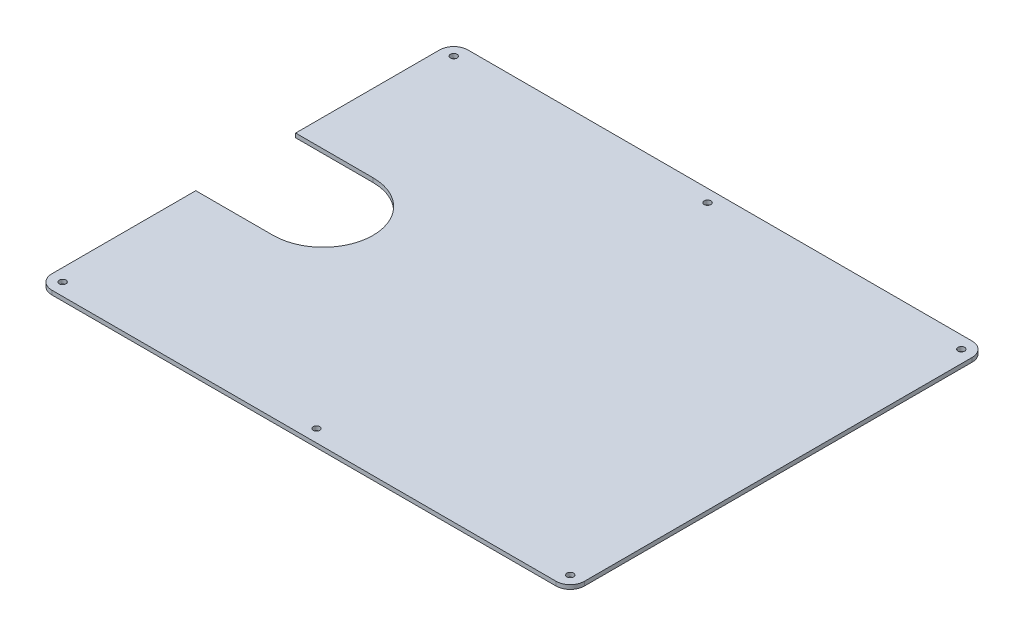
ISO-10303-21;
HEADER;
FILE_DESCRIPTION(('STEP AP214'),'2;1');
FILE_NAME('part.step','',(''),(''),'','','');
FILE_SCHEMA(('AUTOMOTIVE_DESIGN { 1 0 10303 214 1 1 1 1 }'));
ENDSEC;
DATA;
#1=APPLICATION_CONTEXT('core data for automotive mechanical design processes');
#2=APPLICATION_PROTOCOL_DEFINITION('international standard','automotive_design',2000,#1);
#3=PRODUCT_CONTEXT('',#1,'mechanical');
#4=PRODUCT('Part','Part','',(#3));
#5=PRODUCT_RELATED_PRODUCT_CATEGORY('part','',(#4));
#6=PRODUCT_DEFINITION_FORMATION('','',#4);
#7=PRODUCT_DEFINITION_CONTEXT('part definition',#1,'design');
#8=PRODUCT_DEFINITION('design','',#6,#7);
#9=PRODUCT_DEFINITION_SHAPE('','',#8);
#10=(LENGTH_UNIT() NAMED_UNIT(*) SI_UNIT(.MILLI.,.METRE.));
#11=(NAMED_UNIT(*) PLANE_ANGLE_UNIT() SI_UNIT($,.RADIAN.));
#12=(NAMED_UNIT(*) SI_UNIT($,.STERADIAN.) SOLID_ANGLE_UNIT());
#13=UNCERTAINTY_MEASURE_WITH_UNIT(LENGTH_MEASURE(1.E-05),#10,'distance_accuracy_value','');
#14=(GEOMETRIC_REPRESENTATION_CONTEXT(3) GLOBAL_UNCERTAINTY_ASSIGNED_CONTEXT((#13)) GLOBAL_UNIT_ASSIGNED_CONTEXT((#10,
#11,#12)) REPRESENTATION_CONTEXT('',''));
#15=CARTESIAN_POINT('',(0.,0.,0.));
#16=DIRECTION('',(0.,0.,1.));
#17=DIRECTION('',(1.,0.,0.));
#18=AXIS2_PLACEMENT_3D('',#15,#16,#17);
#19=CARTESIAN_POINT('',(-320.,5.,-233.));
#20=DIRECTION('',(1.,0.,0.));
#21=DIRECTION('',(0.,0.,-1.));
#22=AXIS2_PLACEMENT_3D('',#19,#20,#21);
#23=PLANE('',#22);
#24=DIRECTION('',(0.,0.,1.));
#25=VECTOR('',#24,1.);
#26=CARTESIAN_POINT('',(-320.,0.,-233.));
#27=LINE('',#26,#25);
#28=CARTESIAN_POINT('',(-320.,0.,-233.));
#29=VERTEX_POINT('',#28);
#30=CARTESIAN_POINT('',(-320.,0.,-60.));
#31=VERTEX_POINT('',#30);
#32=EDGE_CURVE('E176',#29,#31,#27,.T.);
#33=ORIENTED_EDGE('',*,*,#32,.T.);
#34=DIRECTION('',(0.,-1.,0.));
#35=VECTOR('',#34,1.);
#36=CARTESIAN_POINT('',(-320.,5.,-60.));
#37=LINE('',#36,#35);
#38=CARTESIAN_POINT('',(-320.,5.,-60.));
#39=VERTEX_POINT('',#38);
#40=EDGE_CURVE('E261',#39,#31,#37,.T.);
#41=ORIENTED_EDGE('',*,*,#40,.F.);
#42=DIRECTION('',(0.,0.,1.));
#43=VECTOR('',#42,1.);
#44=CARTESIAN_POINT('',(-320.,5.,-233.));
#45=LINE('',#44,#43);
#46=CARTESIAN_POINT('',(-320.,5.,-233.));
#47=VERTEX_POINT('',#46);
#48=EDGE_CURVE('E153',#47,#39,#45,.T.);
#49=ORIENTED_EDGE('',*,*,#48,.F.);
#50=DIRECTION('',(0.,-1.,0.));
#51=VECTOR('',#50,1.);
#52=CARTESIAN_POINT('',(-320.,5.,-233.));
#53=LINE('',#52,#51);
#54=EDGE_CURVE('E146',#47,#29,#53,.T.);
#55=ORIENTED_EDGE('',*,*,#54,.T.);
#56=EDGE_LOOP('',(#33,#41,#49,#55));
#57=FACE_BOUND('',#56,.T.);
#58=ADVANCED_FACE('F38',(#57),#23,.F.);
#59=CARTESIAN_POINT('',(-303.,5.,233.));
#60=DIRECTION('',(0.,1.,0.));
#61=DIRECTION('',(0.,0.,1.));
#62=AXIS2_PLACEMENT_3D('',#59,#60,#61);
#63=PLANE('',#62);
#64=DIRECTION('',(1.,0.,0.));
#65=VECTOR('',#64,1.);
#66=CARTESIAN_POINT('',(-320.,5.,-60.));
#67=LINE('',#66,#65);
#68=CARTESIAN_POINT('',(-227.,5.,-60.));
#69=VERTEX_POINT('',#68);
#70=EDGE_CURVE('E258',#39,#69,#67,.T.);
#71=ORIENTED_EDGE('',*,*,#70,.T.);
#72=CARTESIAN_POINT('',(-227.,5.,0.));
#73=DIRECTION('',(0.,-1.,0.));
#74=DIRECTION('',(0.,0.,1.));
#75=AXIS2_PLACEMENT_3D('',#72,#73,#74);
#76=CIRCLE('',#75,60.);
#77=CARTESIAN_POINT('',(-227.,5.,60.));
#78=VERTEX_POINT('',#77);
#79=EDGE_CURVE('E269',#69,#78,#76,.T.);
#80=ORIENTED_EDGE('',*,*,#79,.T.);
#81=DIRECTION('',(-1.,0.,0.));
#82=VECTOR('',#81,1.);
#83=CARTESIAN_POINT('',(-227.,5.,60.));
#84=LINE('',#83,#82);
#85=CARTESIAN_POINT('',(-320.,5.,60.));
#86=VERTEX_POINT('',#85);
#87=EDGE_CURVE('E277',#78,#86,#84,.T.);
#88=ORIENTED_EDGE('',*,*,#87,.T.);
#89=CARTESIAN_POINT('',(-320.,5.,233.));
#90=VERTEX_POINT('',#89);
#91=EDGE_CURVE('E65',#86,#90,#45,.T.);
#92=ORIENTED_EDGE('',*,*,#91,.T.);
#93=CARTESIAN_POINT('',(-303.,5.,233.));
#94=DIRECTION('',(0.,1.,0.));
#95=DIRECTION('',(0.,0.,1.));
#96=AXIS2_PLACEMENT_3D('',#93,#94,#95);
#97=CIRCLE('',#96,17.);
#98=CARTESIAN_POINT('',(-303.,5.,250.));
#99=VERTEX_POINT('',#98);
#100=EDGE_CURVE('E179',#90,#99,#97,.T.);
#101=ORIENTED_EDGE('',*,*,#100,.T.);
#102=DIRECTION('',(1.,0.,0.));
#103=VECTOR('',#102,1.);
#104=CARTESIAN_POINT('',(-303.,5.,250.));
#105=LINE('',#104,#103);
#106=CARTESIAN_POINT('',(303.,5.,250.));
#107=VERTEX_POINT('',#106);
#108=EDGE_CURVE('E107',#99,#107,#105,.T.);
#109=ORIENTED_EDGE('',*,*,#108,.T.);
#110=CARTESIAN_POINT('',(303.,5.,233.));
#111=DIRECTION('',(0.,1.,0.));
#112=DIRECTION('',(0.,0.,-1.));
#113=AXIS2_PLACEMENT_3D('',#110,#111,#112);
#114=CIRCLE('',#113,17.);
#115=CARTESIAN_POINT('',(320.,5.,233.));
#116=VERTEX_POINT('',#115);
#117=EDGE_CURVE('E195',#107,#116,#114,.T.);
#118=ORIENTED_EDGE('',*,*,#117,.T.);
#119=DIRECTION('',(0.,0.,-1.));
#120=VECTOR('',#119,1.);
#121=CARTESIAN_POINT('',(320.,5.,-233.));
#122=LINE('',#121,#120);
#123=CARTESIAN_POINT('',(320.,5.,-233.));
#124=VERTEX_POINT('',#123);
#125=EDGE_CURVE('E209',#116,#124,#122,.T.);
#126=ORIENTED_EDGE('',*,*,#125,.T.);
#127=CARTESIAN_POINT('',(303.,5.,-233.));
#128=DIRECTION('',(0.,1.,0.));
#129=DIRECTION('',(0.,0.,-1.));
#130=AXIS2_PLACEMENT_3D('',#127,#128,#129);
#131=CIRCLE('',#130,17.);
#132=CARTESIAN_POINT('',(303.,5.,-250.));
#133=VERTEX_POINT('',#132);
#134=EDGE_CURVE('E133',#124,#133,#131,.T.);
#135=ORIENTED_EDGE('',*,*,#134,.T.);
#136=DIRECTION('',(-1.,0.,0.));
#137=VECTOR('',#136,1.);
#138=CARTESIAN_POINT('',(-303.,5.,-250.));
#139=LINE('',#138,#137);
#140=CARTESIAN_POINT('',(-303.,5.,-250.));
#141=VERTEX_POINT('',#140);
#142=EDGE_CURVE('E123',#133,#141,#139,.T.);
#143=ORIENTED_EDGE('',*,*,#142,.T.);
#144=CARTESIAN_POINT('',(-303.,5.,-233.));
#145=DIRECTION('',(0.,1.,0.));
#146=DIRECTION('',(0.,0.,1.));
#147=AXIS2_PLACEMENT_3D('',#144,#145,#146);
#148=CIRCLE('',#147,17.);
#149=EDGE_CURVE('E130',#141,#47,#148,.T.);
#150=ORIENTED_EDGE('',*,*,#149,.T.);
#151=ORIENTED_EDGE('',*,*,#48,.T.);
#152=EDGE_LOOP('',(#71,#80,#88,#92,#101,#109,#118,#126,#135,#143,#150,#151));
#153=FACE_BOUND('',#152,.T.);
#154=CARTESIAN_POINT('',(305.,5.,235.));
#155=DIRECTION('',(0.,1.,0.));
#156=DIRECTION('',(0.,0.,1.));
#157=AXIS2_PLACEMENT_3D('',#154,#155,#156);
#158=CIRCLE('',#157,3.99999999999999);
#159=CARTESIAN_POINT('',(305.,5.,239.));
#160=VERTEX_POINT('',#159);
#161=EDGE_CURVE('E238',#160,#160,#158,.T.);
#162=ORIENTED_EDGE('',*,*,#161,.F.);
#163=EDGE_LOOP('',(#162));
#164=FACE_BOUND('',#163,.T.);
#165=CARTESIAN_POINT('',(-305.,5.,-235.));
#166=DIRECTION('',(0.,1.,0.));
#167=DIRECTION('',(0.,0.,1.));
#168=AXIS2_PLACEMENT_3D('',#165,#166,#167);
#169=CIRCLE('',#168,3.99999999999999);
#170=CARTESIAN_POINT('',(-305.,5.,-231.));
#171=VERTEX_POINT('',#170);
#172=EDGE_CURVE('E226',#171,#171,#169,.T.);
#173=ORIENTED_EDGE('',*,*,#172,.F.);
#174=EDGE_LOOP('',(#173));
#175=FACE_BOUND('',#174,.T.);
#176=CARTESIAN_POINT('',(0.,5.,-235.));
#177=DIRECTION('',(0.,1.,0.));
#178=DIRECTION('',(0.,0.,1.));
#179=AXIS2_PLACEMENT_3D('',#176,#177,#178);
#180=CIRCLE('',#179,4.);
#181=CARTESIAN_POINT('',(0.,5.,-231.));
#182=VERTEX_POINT('',#181);
#183=EDGE_CURVE('E162',#182,#182,#180,.T.);
#184=ORIENTED_EDGE('',*,*,#183,.F.);
#185=EDGE_LOOP('',(#184));
#186=FACE_BOUND('',#185,.T.);
#187=CARTESIAN_POINT('',(305.,5.,-235.));
#188=DIRECTION('',(0.,1.,0.));
#189=DIRECTION('',(0.,0.,1.));
#190=AXIS2_PLACEMENT_3D('',#187,#188,#189);
#191=CIRCLE('',#190,3.99999999999999);
#192=CARTESIAN_POINT('',(305.,5.,-231.));
#193=VERTEX_POINT('',#192);
#194=EDGE_CURVE('E220',#193,#193,#191,.T.);
#195=ORIENTED_EDGE('',*,*,#194,.F.);
#196=EDGE_LOOP('',(#195));
#197=FACE_BOUND('',#196,.T.);
#198=CARTESIAN_POINT('',(0.,5.,235.));
#199=DIRECTION('',(0.,1.,0.));
#200=DIRECTION('',(0.,0.,1.));
#201=AXIS2_PLACEMENT_3D('',#198,#199,#200);
#202=CIRCLE('',#201,4.);
#203=CARTESIAN_POINT('',(0.,5.,239.));
#204=VERTEX_POINT('',#203);
#205=EDGE_CURVE('E232',#204,#204,#202,.T.);
#206=ORIENTED_EDGE('',*,*,#205,.F.);
#207=EDGE_LOOP('',(#206));
#208=FACE_BOUND('',#207,.T.);
#209=CARTESIAN_POINT('',(-305.,5.,235.));
#210=DIRECTION('',(0.,1.,0.));
#211=DIRECTION('',(0.,0.,1.));
#212=AXIS2_PLACEMENT_3D('',#209,#210,#211);
#213=CIRCLE('',#212,3.99999999999999);
#214=CARTESIAN_POINT('',(-305.,5.,239.));
#215=VERTEX_POINT('',#214);
#216=EDGE_CURVE('E245',#215,#215,#213,.T.);
#217=ORIENTED_EDGE('',*,*,#216,.F.);
#218=EDGE_LOOP('',(#217));
#219=FACE_BOUND('',#218,.T.);
#220=ADVANCED_FACE('F126',(#153,#164,#175,#186,#197,#208,#219),#63,.T.);
#221=CARTESIAN_POINT('',(-303.,0.,233.));
#222=DIRECTION('',(0.,1.,0.));
#223=DIRECTION('',(0.,0.,1.));
#224=AXIS2_PLACEMENT_3D('',#221,#222,#223);
#225=PLANE('',#224);
#226=CARTESIAN_POINT('',(-227.,0.,0.));
#227=DIRECTION('',(0.,-1.,0.));
#228=DIRECTION('',(0.,0.,1.));
#229=AXIS2_PLACEMENT_3D('',#226,#227,#228);
#230=CIRCLE('',#229,60.);
#231=CARTESIAN_POINT('',(-227.,0.,-60.));
#232=VERTEX_POINT('',#231);
#233=CARTESIAN_POINT('',(-227.,0.,60.));
#234=VERTEX_POINT('',#233);
#235=EDGE_CURVE('E272',#232,#234,#230,.T.);
#236=ORIENTED_EDGE('',*,*,#235,.F.);
#237=DIRECTION('',(1.,0.,0.));
#238=VECTOR('',#237,1.);
#239=CARTESIAN_POINT('',(-320.,0.,-60.));
#240=LINE('',#239,#238);
#241=EDGE_CURVE('E266',#31,#232,#240,.T.);
#242=ORIENTED_EDGE('',*,*,#241,.F.);
#243=ORIENTED_EDGE('',*,*,#32,.F.);
#244=CARTESIAN_POINT('',(-303.,0.,-233.));
#245=DIRECTION('',(0.,1.,0.));
#246=DIRECTION('',(0.,0.,1.));
#247=AXIS2_PLACEMENT_3D('',#244,#245,#246);
#248=CIRCLE('',#247,17.);
#249=CARTESIAN_POINT('',(-303.,0.,-250.));
#250=VERTEX_POINT('',#249);
#251=EDGE_CURVE('E174',#250,#29,#248,.T.);
#252=ORIENTED_EDGE('',*,*,#251,.F.);
#253=DIRECTION('',(-1.,0.,0.));
#254=VECTOR('',#253,1.);
#255=CARTESIAN_POINT('',(-303.,0.,-250.));
#256=LINE('',#255,#254);
#257=CARTESIAN_POINT('',(303.,0.,-250.));
#258=VERTEX_POINT('',#257);
#259=EDGE_CURVE('E142',#258,#250,#256,.T.);
#260=ORIENTED_EDGE('',*,*,#259,.F.);
#261=CARTESIAN_POINT('',(303.,0.,-233.));
#262=DIRECTION('',(0.,1.,0.));
#263=DIRECTION('',(0.,0.,-1.));
#264=AXIS2_PLACEMENT_3D('',#261,#262,#263);
#265=CIRCLE('',#264,17.);
#266=CARTESIAN_POINT('',(320.,0.,-233.));
#267=VERTEX_POINT('',#266);
#268=EDGE_CURVE('E171',#267,#258,#265,.T.);
#269=ORIENTED_EDGE('',*,*,#268,.F.);
#270=DIRECTION('',(0.,0.,-1.));
#271=VECTOR('',#270,1.);
#272=CARTESIAN_POINT('',(320.,0.,-233.));
#273=LINE('',#272,#271);
#274=CARTESIAN_POINT('',(320.,0.,233.));
#275=VERTEX_POINT('',#274);
#276=EDGE_CURVE('E168',#275,#267,#273,.T.);
#277=ORIENTED_EDGE('',*,*,#276,.F.);
#278=CARTESIAN_POINT('',(303.,0.,233.));
#279=DIRECTION('',(0.,1.,0.));
#280=DIRECTION('',(0.,0.,-1.));
#281=AXIS2_PLACEMENT_3D('',#278,#279,#280);
#282=CIRCLE('',#281,17.);
#283=CARTESIAN_POINT('',(303.,0.,250.));
#284=VERTEX_POINT('',#283);
#285=EDGE_CURVE('E165',#284,#275,#282,.T.);
#286=ORIENTED_EDGE('',*,*,#285,.F.);
#287=DIRECTION('',(1.,0.,0.));
#288=VECTOR('',#287,1.);
#289=CARTESIAN_POINT('',(-303.,0.,250.));
#290=LINE('',#289,#288);
#291=CARTESIAN_POINT('',(-303.,0.,250.));
#292=VERTEX_POINT('',#291);
#293=EDGE_CURVE('E161',#292,#284,#290,.T.);
#294=ORIENTED_EDGE('',*,*,#293,.F.);
#295=CARTESIAN_POINT('',(-303.,0.,233.));
#296=DIRECTION('',(0.,1.,0.));
#297=DIRECTION('',(0.,0.,1.));
#298=AXIS2_PLACEMENT_3D('',#295,#296,#297);
#299=CIRCLE('',#298,17.);
#300=CARTESIAN_POINT('',(-320.,0.,233.));
#301=VERTEX_POINT('',#300);
#302=EDGE_CURVE('E158',#301,#292,#299,.T.);
#303=ORIENTED_EDGE('',*,*,#302,.F.);
#304=CARTESIAN_POINT('',(-320.,0.,60.0000000000001));
#305=VERTEX_POINT('',#304);
#306=EDGE_CURVE('E99',#305,#301,#27,.T.);
#307=ORIENTED_EDGE('',*,*,#306,.F.);
#308=DIRECTION('',(-1.,0.,0.));
#309=VECTOR('',#308,1.);
#310=CARTESIAN_POINT('',(-227.,0.,60.));
#311=LINE('',#310,#309);
#312=EDGE_CURVE('E56',#234,#305,#311,.T.);
#313=ORIENTED_EDGE('',*,*,#312,.F.);
#314=EDGE_LOOP('',(#236,#242,#243,#252,#260,#269,#277,#286,#294,#303,#307,#313));
#315=FACE_BOUND('',#314,.T.);
#316=CARTESIAN_POINT('',(0.,0.,-235.));
#317=DIRECTION('',(0.,1.,0.));
#318=DIRECTION('',(0.,0.,1.));
#319=AXIS2_PLACEMENT_3D('',#316,#317,#318);
#320=CIRCLE('',#319,4.);
#321=CARTESIAN_POINT('',(0.,0.,-231.));
#322=VERTEX_POINT('',#321);
#323=EDGE_CURVE('E217',#322,#322,#320,.T.);
#324=ORIENTED_EDGE('',*,*,#323,.T.);
#325=EDGE_LOOP('',(#324));
#326=FACE_BOUND('',#325,.T.);
#327=CARTESIAN_POINT('',(305.,0.,-235.));
#328=DIRECTION('',(0.,1.,0.));
#329=DIRECTION('',(0.,0.,1.));
#330=AXIS2_PLACEMENT_3D('',#327,#328,#329);
#331=CIRCLE('',#330,3.99999999999999);
#332=CARTESIAN_POINT('',(305.,0.,-231.));
#333=VERTEX_POINT('',#332);
#334=EDGE_CURVE('E223',#333,#333,#331,.T.);
#335=ORIENTED_EDGE('',*,*,#334,.T.);
#336=EDGE_LOOP('',(#335));
#337=FACE_BOUND('',#336,.T.);
#338=CARTESIAN_POINT('',(-305.,0.,-235.));
#339=DIRECTION('',(0.,1.,0.));
#340=DIRECTION('',(0.,0.,1.));
#341=AXIS2_PLACEMENT_3D('',#338,#339,#340);
#342=CIRCLE('',#341,3.99999999999999);
#343=CARTESIAN_POINT('',(-305.,0.,-231.));
#344=VERTEX_POINT('',#343);
#345=EDGE_CURVE('E229',#344,#344,#342,.T.);
#346=ORIENTED_EDGE('',*,*,#345,.T.);
#347=EDGE_LOOP('',(#346));
#348=FACE_BOUND('',#347,.T.);
#349=CARTESIAN_POINT('',(0.,0.,235.));
#350=DIRECTION('',(0.,1.,0.));
#351=DIRECTION('',(0.,0.,1.));
#352=AXIS2_PLACEMENT_3D('',#349,#350,#351);
#353=CIRCLE('',#352,4.);
#354=CARTESIAN_POINT('',(0.,0.,239.));
#355=VERTEX_POINT('',#354);
#356=EDGE_CURVE('E235',#355,#355,#353,.T.);
#357=ORIENTED_EDGE('',*,*,#356,.T.);
#358=EDGE_LOOP('',(#357));
#359=FACE_BOUND('',#358,.T.);
#360=CARTESIAN_POINT('',(305.,0.,235.));
#361=DIRECTION('',(0.,1.,0.));
#362=DIRECTION('',(0.,0.,1.));
#363=AXIS2_PLACEMENT_3D('',#360,#361,#362);
#364=CIRCLE('',#363,3.99999999999999);
#365=CARTESIAN_POINT('',(305.,0.,239.));
#366=VERTEX_POINT('',#365);
#367=EDGE_CURVE('E241',#366,#366,#364,.T.);
#368=ORIENTED_EDGE('',*,*,#367,.T.);
#369=EDGE_LOOP('',(#368));
#370=FACE_BOUND('',#369,.T.);
#371=CARTESIAN_POINT('',(-305.,0.,235.));
#372=DIRECTION('',(0.,1.,0.));
#373=DIRECTION('',(0.,0.,1.));
#374=AXIS2_PLACEMENT_3D('',#371,#372,#373);
#375=CIRCLE('',#374,3.99999999999999);
#376=CARTESIAN_POINT('',(-305.,0.,239.));
#377=VERTEX_POINT('',#376);
#378=EDGE_CURVE('E249',#377,#377,#375,.T.);
#379=ORIENTED_EDGE('',*,*,#378,.T.);
#380=EDGE_LOOP('',(#379));
#381=FACE_BOUND('',#380,.T.);
#382=ADVANCED_FACE('F199',(#315,#326,#337,#348,#359,#370,#381),#225,.F.);
#383=CARTESIAN_POINT('',(-303.,5.,233.));
#384=DIRECTION('',(0.,-1.,0.));
#385=DIRECTION('',(0.,0.,-1.));
#386=AXIS2_PLACEMENT_3D('',#383,#384,#385);
#387=CYLINDRICAL_SURFACE('',#386,17.);
#388=ORIENTED_EDGE('',*,*,#302,.T.);
#389=DIRECTION('',(0.,-1.,0.));
#390=VECTOR('',#389,1.);
#391=CARTESIAN_POINT('',(-303.,5.,250.));
#392=LINE('',#391,#390);
#393=EDGE_CURVE('E11',#99,#292,#392,.T.);
#394=ORIENTED_EDGE('',*,*,#393,.F.);
#395=ORIENTED_EDGE('',*,*,#100,.F.);
#396=DIRECTION('',(0.,-1.,0.));
#397=VECTOR('',#396,1.);
#398=CARTESIAN_POINT('',(-320.,5.,233.));
#399=LINE('',#398,#397);
#400=EDGE_CURVE('E157',#90,#301,#399,.T.);
#401=ORIENTED_EDGE('',*,*,#400,.T.);
#402=EDGE_LOOP('',(#388,#394,#395,#401));
#403=FACE_BOUND('',#402,.T.);
#404=ADVANCED_FACE('F40',(#403),#387,.T.);
#405=CARTESIAN_POINT('',(-303.,5.,250.));
#406=DIRECTION('',(0.,0.,-1.));
#407=DIRECTION('',(-1.,0.,0.));
#408=AXIS2_PLACEMENT_3D('',#405,#406,#407);
#409=PLANE('',#408);
#410=ORIENTED_EDGE('',*,*,#293,.T.);
#411=DIRECTION('',(0.,-1.,0.));
#412=VECTOR('',#411,1.);
#413=CARTESIAN_POINT('',(303.,5.,250.));
#414=LINE('',#413,#412);
#415=EDGE_CURVE('E46',#107,#284,#414,.T.);
#416=ORIENTED_EDGE('',*,*,#415,.F.);
#417=ORIENTED_EDGE('',*,*,#108,.F.);
#418=ORIENTED_EDGE('',*,*,#393,.T.);
#419=EDGE_LOOP('',(#410,#416,#417,#418));
#420=FACE_BOUND('',#419,.T.);
#421=ADVANCED_FACE('F328',(#420),#409,.F.);
#422=CARTESIAN_POINT('',(303.,5.,233.));
#423=DIRECTION('',(0.,-1.,0.));
#424=DIRECTION('',(0.,0.,-1.));
#425=AXIS2_PLACEMENT_3D('',#422,#423,#424);
#426=CYLINDRICAL_SURFACE('',#425,17.);
#427=ORIENTED_EDGE('',*,*,#285,.T.);
#428=DIRECTION('',(0.,-1.,0.));
#429=VECTOR('',#428,1.);
#430=CARTESIAN_POINT('',(320.,5.,233.));
#431=LINE('',#430,#429);
#432=EDGE_CURVE('E186',#116,#275,#431,.T.);
#433=ORIENTED_EDGE('',*,*,#432,.F.);
#434=ORIENTED_EDGE('',*,*,#117,.F.);
#435=ORIENTED_EDGE('',*,*,#415,.T.);
#436=EDGE_LOOP('',(#427,#433,#434,#435));
#437=FACE_BOUND('',#436,.T.);
#438=ADVANCED_FACE('F193',(#437),#426,.T.);
#439=CARTESIAN_POINT('',(320.,5.,-233.));
#440=DIRECTION('',(-1.,0.,0.));
#441=DIRECTION('',(0.,0.,1.));
#442=AXIS2_PLACEMENT_3D('',#439,#440,#441);
#443=PLANE('',#442);
#444=ORIENTED_EDGE('',*,*,#276,.T.);
#445=DIRECTION('',(0.,-1.,0.));
#446=VECTOR('',#445,1.);
#447=CARTESIAN_POINT('',(320.,5.,-233.));
#448=LINE('',#447,#446);
#449=EDGE_CURVE('E183',#124,#267,#448,.T.);
#450=ORIENTED_EDGE('',*,*,#449,.F.);
#451=ORIENTED_EDGE('',*,*,#125,.F.);
#452=ORIENTED_EDGE('',*,*,#432,.T.);
#453=EDGE_LOOP('',(#444,#450,#451,#452));
#454=FACE_BOUND('',#453,.T.);
#455=ADVANCED_FACE('F205',(#454),#443,.F.);
#456=CARTESIAN_POINT('',(303.,5.,-233.));
#457=DIRECTION('',(0.,-1.,0.));
#458=DIRECTION('',(0.,0.,-1.));
#459=AXIS2_PLACEMENT_3D('',#456,#457,#458);
#460=CYLINDRICAL_SURFACE('',#459,17.);
#461=ORIENTED_EDGE('',*,*,#268,.T.);
#462=DIRECTION('',(0.,-1.,0.));
#463=VECTOR('',#462,1.);
#464=CARTESIAN_POINT('',(303.,5.,-250.));
#465=LINE('',#464,#463);
#466=EDGE_CURVE('E145',#133,#258,#465,.T.);
#467=ORIENTED_EDGE('',*,*,#466,.F.);
#468=ORIENTED_EDGE('',*,*,#134,.F.);
#469=ORIENTED_EDGE('',*,*,#449,.T.);
#470=EDGE_LOOP('',(#461,#467,#468,#469));
#471=FACE_BOUND('',#470,.T.);
#472=ADVANCED_FACE('F208',(#471),#460,.T.);
#473=CARTESIAN_POINT('',(-303.,5.,-250.));
#474=DIRECTION('',(0.,0.,1.));
#475=DIRECTION('',(1.,0.,0.));
#476=AXIS2_PLACEMENT_3D('',#473,#474,#475);
#477=PLANE('',#476);
#478=ORIENTED_EDGE('',*,*,#259,.T.);
#479=DIRECTION('',(0.,-1.,0.));
#480=VECTOR('',#479,1.);
#481=CARTESIAN_POINT('',(-303.,5.,-250.));
#482=LINE('',#481,#480);
#483=EDGE_CURVE('E139',#141,#250,#482,.T.);
#484=ORIENTED_EDGE('',*,*,#483,.F.);
#485=ORIENTED_EDGE('',*,*,#142,.F.);
#486=ORIENTED_EDGE('',*,*,#466,.T.);
#487=EDGE_LOOP('',(#478,#484,#485,#486));
#488=FACE_BOUND('',#487,.T.);
#489=ADVANCED_FACE('F140',(#488),#477,.F.);
#490=CARTESIAN_POINT('',(-303.,5.,-233.));
#491=DIRECTION('',(0.,-1.,0.));
#492=DIRECTION('',(0.,0.,-1.));
#493=AXIS2_PLACEMENT_3D('',#490,#491,#492);
#494=CYLINDRICAL_SURFACE('',#493,17.);
#495=ORIENTED_EDGE('',*,*,#251,.T.);
#496=ORIENTED_EDGE('',*,*,#54,.F.);
#497=ORIENTED_EDGE('',*,*,#149,.F.);
#498=ORIENTED_EDGE('',*,*,#483,.T.);
#499=EDGE_LOOP('',(#495,#496,#497,#498));
#500=FACE_BOUND('',#499,.T.);
#501=ADVANCED_FACE('F148',(#500),#494,.T.);
#502=ORIENTED_EDGE('',*,*,#91,.F.);
#503=DIRECTION('',(0.,-1.,0.));
#504=VECTOR('',#503,1.);
#505=CARTESIAN_POINT('',(-320.,5.,60.));
#506=LINE('',#505,#504);
#507=EDGE_CURVE('E257',#86,#305,#506,.T.);
#508=ORIENTED_EDGE('',*,*,#507,.T.);
#509=ORIENTED_EDGE('',*,*,#306,.T.);
#510=ORIENTED_EDGE('',*,*,#400,.F.);
#511=EDGE_LOOP('',(#502,#508,#509,#510));
#512=FACE_BOUND('',#511,.T.);
#513=ADVANCED_FACE('F307',(#512),#23,.F.);
#514=CARTESIAN_POINT('',(0.,5.,-235.));
#515=DIRECTION('',(0.,-1.,0.));
#516=DIRECTION('',(0.,0.,-1.));
#517=AXIS2_PLACEMENT_3D('',#514,#515,#516);
#518=CYLINDRICAL_SURFACE('',#517,4.);
#519=ORIENTED_EDGE('',*,*,#183,.T.);
#520=EDGE_LOOP('',(#519));
#521=FACE_BOUND('',#520,.T.);
#522=ORIENTED_EDGE('',*,*,#323,.F.);
#523=EDGE_LOOP('',(#522));
#524=FACE_BOUND('',#523,.T.);
#525=ADVANCED_FACE('F315',(#521,#524),#518,.F.);
#526=CARTESIAN_POINT('',(305.,5.,-235.));
#527=DIRECTION('',(0.,-1.,0.));
#528=DIRECTION('',(0.,0.,-1.));
#529=AXIS2_PLACEMENT_3D('',#526,#527,#528);
#530=CYLINDRICAL_SURFACE('',#529,3.99999999999999);
#531=ORIENTED_EDGE('',*,*,#194,.T.);
#532=EDGE_LOOP('',(#531));
#533=FACE_BOUND('',#532,.T.);
#534=ORIENTED_EDGE('',*,*,#334,.F.);
#535=EDGE_LOOP('',(#534));
#536=FACE_BOUND('',#535,.T.);
#537=ADVANCED_FACE('F320',(#533,#536),#530,.F.);
#538=CARTESIAN_POINT('',(-305.,5.,-235.));
#539=DIRECTION('',(0.,-1.,0.));
#540=DIRECTION('',(0.,0.,-1.));
#541=AXIS2_PLACEMENT_3D('',#538,#539,#540);
#542=CYLINDRICAL_SURFACE('',#541,3.99999999999999);
#543=ORIENTED_EDGE('',*,*,#172,.T.);
#544=EDGE_LOOP('',(#543));
#545=FACE_BOUND('',#544,.T.);
#546=ORIENTED_EDGE('',*,*,#345,.F.);
#547=EDGE_LOOP('',(#546));
#548=FACE_BOUND('',#547,.T.);
#549=ADVANCED_FACE('F365',(#545,#548),#542,.F.);
#550=CARTESIAN_POINT('',(0.,5.,235.));
#551=DIRECTION('',(0.,-1.,0.));
#552=DIRECTION('',(0.,0.,-1.));
#553=AXIS2_PLACEMENT_3D('',#550,#551,#552);
#554=CYLINDRICAL_SURFACE('',#553,4.);
#555=ORIENTED_EDGE('',*,*,#205,.T.);
#556=EDGE_LOOP('',(#555));
#557=FACE_BOUND('',#556,.T.);
#558=ORIENTED_EDGE('',*,*,#356,.F.);
#559=EDGE_LOOP('',(#558));
#560=FACE_BOUND('',#559,.T.);
#561=ADVANCED_FACE('F375',(#557,#560),#554,.F.);
#562=CARTESIAN_POINT('',(305.,5.,235.));
#563=DIRECTION('',(0.,-1.,0.));
#564=DIRECTION('',(0.,0.,-1.));
#565=AXIS2_PLACEMENT_3D('',#562,#563,#564);
#566=CYLINDRICAL_SURFACE('',#565,3.99999999999999);
#567=ORIENTED_EDGE('',*,*,#161,.T.);
#568=EDGE_LOOP('',(#567));
#569=FACE_BOUND('',#568,.T.);
#570=ORIENTED_EDGE('',*,*,#367,.F.);
#571=EDGE_LOOP('',(#570));
#572=FACE_BOUND('',#571,.T.);
#573=ADVANCED_FACE('F385',(#569,#572),#566,.F.);
#574=CARTESIAN_POINT('',(-305.,5.,235.));
#575=DIRECTION('',(0.,-1.,0.));
#576=DIRECTION('',(0.,0.,-1.));
#577=AXIS2_PLACEMENT_3D('',#574,#575,#576);
#578=CYLINDRICAL_SURFACE('',#577,3.99999999999999);
#579=ORIENTED_EDGE('',*,*,#216,.T.);
#580=EDGE_LOOP('',(#579));
#581=FACE_BOUND('',#580,.T.);
#582=ORIENTED_EDGE('',*,*,#378,.F.);
#583=EDGE_LOOP('',(#582));
#584=FACE_BOUND('',#583,.T.);
#585=ADVANCED_FACE('F395',(#581,#584),#578,.F.);
#586=CARTESIAN_POINT('',(-227.,5.,0.));
#587=DIRECTION('',(0.,-1.,0.));
#588=DIRECTION('',(0.,0.,-1.));
#589=AXIS2_PLACEMENT_3D('',#586,#587,#588);
#590=CYLINDRICAL_SURFACE('',#589,60.);
#591=ORIENTED_EDGE('',*,*,#235,.T.);
#592=DIRECTION('',(0.,-1.,0.));
#593=VECTOR('',#592,1.);
#594=CARTESIAN_POINT('',(-227.,5.,60.));
#595=LINE('',#594,#593);
#596=EDGE_CURVE('E255',#78,#234,#595,.T.);
#597=ORIENTED_EDGE('',*,*,#596,.F.);
#598=ORIENTED_EDGE('',*,*,#79,.F.);
#599=DIRECTION('',(0.,-1.,0.));
#600=VECTOR('',#599,1.);
#601=CARTESIAN_POINT('',(-227.,5.,-60.));
#602=LINE('',#601,#600);
#603=EDGE_CURVE('E252',#69,#232,#602,.T.);
#604=ORIENTED_EDGE('',*,*,#603,.T.);
#605=EDGE_LOOP('',(#591,#597,#598,#604));
#606=FACE_BOUND('',#605,.T.);
#607=ADVANCED_FACE('F290',(#606),#590,.F.);
#608=CARTESIAN_POINT('',(-320.,5.,-60.));
#609=DIRECTION('',(0.,0.,-1.));
#610=DIRECTION('',(-1.,0.,0.));
#611=AXIS2_PLACEMENT_3D('',#608,#609,#610);
#612=PLANE('',#611);
#613=ORIENTED_EDGE('',*,*,#241,.T.);
#614=ORIENTED_EDGE('',*,*,#603,.F.);
#615=ORIENTED_EDGE('',*,*,#70,.F.);
#616=ORIENTED_EDGE('',*,*,#40,.T.);
#617=EDGE_LOOP('',(#613,#614,#615,#616));
#618=FACE_BOUND('',#617,.T.);
#619=ADVANCED_FACE('F302',(#618),#612,.F.);
#620=CARTESIAN_POINT('',(-227.,5.,60.));
#621=DIRECTION('',(0.,0.,1.));
#622=DIRECTION('',(1.,0.,0.));
#623=AXIS2_PLACEMENT_3D('',#620,#621,#622);
#624=PLANE('',#623);
#625=ORIENTED_EDGE('',*,*,#312,.T.);
#626=ORIENTED_EDGE('',*,*,#507,.F.);
#627=ORIENTED_EDGE('',*,*,#87,.F.);
#628=ORIENTED_EDGE('',*,*,#596,.T.);
#629=EDGE_LOOP('',(#625,#626,#627,#628));
#630=FACE_BOUND('',#629,.T.);
#631=ADVANCED_FACE('F324',(#630),#624,.F.);
#632=CLOSED_SHELL('',(#58,#220,#382,#404,#421,#438,#455,#472,#489,#501,#513,#525,#537,#549,#561,
#573,#585,#607,#619,#631));
#633=MANIFOLD_SOLID_BREP('B2',#632);
#634=ADVANCED_BREP_SHAPE_REPRESENTATION('',(#18,#633),#14);
#635=SHAPE_DEFINITION_REPRESENTATION(#9,#634);
ENDSEC;
END-ISO-10303-21;
